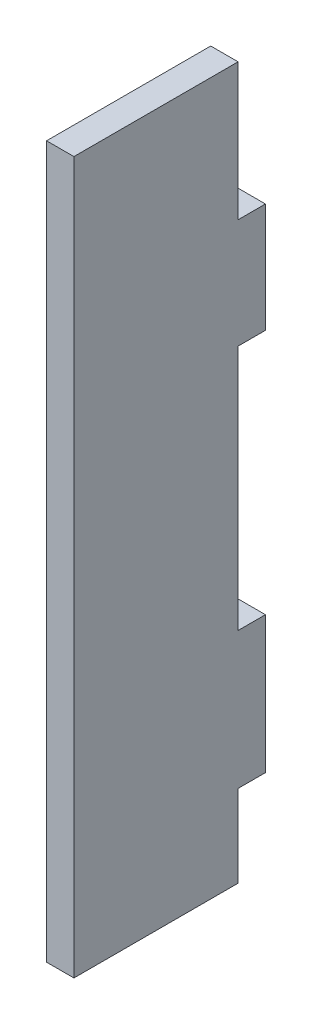
ISO-10303-21;
HEADER;
FILE_DESCRIPTION(('STEP AP214'),'2;1');
FILE_NAME('part.step','',(''),(''),'','','');
FILE_SCHEMA(('AUTOMOTIVE_DESIGN { 1 0 10303 214 1 1 1 1 }'));
ENDSEC;
DATA;
#1=APPLICATION_CONTEXT('core data for automotive mechanical design processes');
#2=APPLICATION_PROTOCOL_DEFINITION('international standard','automotive_design',2000,#1);
#3=PRODUCT_CONTEXT('',#1,'mechanical');
#4=PRODUCT('Part','Part','',(#3));
#5=PRODUCT_RELATED_PRODUCT_CATEGORY('part','',(#4));
#6=PRODUCT_DEFINITION_FORMATION('','',#4);
#7=PRODUCT_DEFINITION_CONTEXT('part definition',#1,'design');
#8=PRODUCT_DEFINITION('design','',#6,#7);
#9=PRODUCT_DEFINITION_SHAPE('','',#8);
#10=(LENGTH_UNIT() NAMED_UNIT(*) SI_UNIT(.MILLI.,.METRE.));
#11=(NAMED_UNIT(*) PLANE_ANGLE_UNIT() SI_UNIT($,.RADIAN.));
#12=(NAMED_UNIT(*) SI_UNIT($,.STERADIAN.) SOLID_ANGLE_UNIT());
#13=UNCERTAINTY_MEASURE_WITH_UNIT(LENGTH_MEASURE(1.E-05),#10,'distance_accuracy_value','');
#14=(GEOMETRIC_REPRESENTATION_CONTEXT(3) GLOBAL_UNCERTAINTY_ASSIGNED_CONTEXT((#13)) GLOBAL_UNIT_ASSIGNED_CONTEXT((#10,
#11,#12)) REPRESENTATION_CONTEXT('',''));
#15=CARTESIAN_POINT('',(0.,0.,0.));
#16=DIRECTION('',(0.,0.,1.));
#17=DIRECTION('',(1.,0.,0.));
#18=AXIS2_PLACEMENT_3D('',#15,#16,#17);
#19=CARTESIAN_POINT('',(0.,0.,5.));
#20=DIRECTION('',(0.,0.,1.));
#21=DIRECTION('',(1.,0.,0.));
#22=AXIS2_PLACEMENT_3D('',#19,#20,#21);
#23=PLANE('',#22);
#24=DIRECTION('',(1.,0.,0.));
#25=VECTOR('',#24,1.);
#26=CARTESIAN_POINT('',(-25.3835898575689,-44.1369228204701,5.));
#27=LINE('',#26,#25);
#28=CARTESIAN_POINT('',(-25.3835898575689,-44.1369228204701,5.));
#29=VERTEX_POINT('',#28);
#30=CARTESIAN_POINT('',(-20.3835898575689,-44.1369228204701,5.));
#31=VERTEX_POINT('',#30);
#32=EDGE_CURVE('E50',#29,#31,#27,.T.);
#33=ORIENTED_EDGE('',*,*,#32,.T.);
#34=DIRECTION('',(0.,1.,0.));
#35=VECTOR('',#34,1.);
#36=CARTESIAN_POINT('',(-20.3835898575689,70.8630771795299,5.));
#37=LINE('',#36,#35);
#38=CARTESIAN_POINT('',(-20.3835898575689,-59.1369228204701,5.));
#39=VERTEX_POINT('',#38);
#40=EDGE_CURVE('E142',#39,#31,#37,.T.);
#41=ORIENTED_EDGE('',*,*,#40,.F.);
#42=DIRECTION('',(1.,0.,0.));
#43=VECTOR('',#42,1.);
#44=CARTESIAN_POINT('',(-25.3835898575689,-59.1369228204701,5.));
#45=LINE('',#44,#43);
#46=CARTESIAN_POINT('',(-25.3835898575689,-59.1369228204701,5.));
#47=VERTEX_POINT('',#46);
#48=EDGE_CURVE('E158',#47,#39,#45,.T.);
#49=ORIENTED_EDGE('',*,*,#48,.F.);
#50=DIRECTION('',(0.,-1.,0.));
#51=VECTOR('',#50,1.);
#52=CARTESIAN_POINT('',(-25.3835898575689,70.8630771795299,5.));
#53=LINE('',#52,#51);
#54=EDGE_CURVE('E135',#29,#47,#53,.T.);
#55=ORIENTED_EDGE('',*,*,#54,.F.);
#56=EDGE_LOOP('',(#33,#41,#49,#55));
#57=FACE_BOUND('',#56,.T.);
#58=ADVANCED_FACE('F35',(#57),#23,.F.);
#59=DIRECTION('',(-1.,0.,0.));
#60=VECTOR('',#59,1.);
#61=CARTESIAN_POINT('',(-20.3835898575689,-19.1369228204701,5.));
#62=LINE('',#61,#60);
#63=CARTESIAN_POINT('',(-20.3835898575689,-19.1369228204701,5.));
#64=VERTEX_POINT('',#63);
#65=CARTESIAN_POINT('',(-25.3835898575689,-19.1369228204701,5.));
#66=VERTEX_POINT('',#65);
#67=EDGE_CURVE('E143',#64,#66,#62,.T.);
#68=ORIENTED_EDGE('',*,*,#67,.T.);
#69=CARTESIAN_POINT('',(-25.3835898575689,25.8630771795299,5.));
#70=VERTEX_POINT('',#69);
#71=EDGE_CURVE('E166',#70,#66,#53,.T.);
#72=ORIENTED_EDGE('',*,*,#71,.F.);
#73=DIRECTION('',(1.,0.,0.));
#74=VECTOR('',#73,1.);
#75=CARTESIAN_POINT('',(-25.3835898575689,25.8630771795299,5.));
#76=LINE('',#75,#74);
#77=CARTESIAN_POINT('',(-20.3835898575689,25.8630771795299,5.));
#78=VERTEX_POINT('',#77);
#79=EDGE_CURVE('E219',#70,#78,#76,.T.);
#80=ORIENTED_EDGE('',*,*,#79,.T.);
#81=EDGE_CURVE('E152',#64,#78,#37,.T.);
#82=ORIENTED_EDGE('',*,*,#81,.F.);
#83=EDGE_LOOP('',(#68,#72,#80,#82));
#84=FACE_BOUND('',#83,.T.);
#85=ADVANCED_FACE('F197',(#84),#23,.F.);
#86=CARTESIAN_POINT('',(-20.3835898575689,45.8630771795299,5.));
#87=DIRECTION('',(0.,-1.,0.));
#88=DIRECTION('',(0.,0.,-1.));
#89=AXIS2_PLACEMENT_3D('',#86,#87,#88);
#90=PLANE('',#89);
#91=DIRECTION('',(-1.,0.,0.));
#92=VECTOR('',#91,1.);
#93=CARTESIAN_POINT('',(-20.3835898575689,45.8630771795299,0.));
#94=LINE('',#93,#92);
#95=CARTESIAN_POINT('',(-20.3835898575689,45.8630771795299,0.));
#96=VERTEX_POINT('',#95);
#97=CARTESIAN_POINT('',(-25.3835898575689,45.8630771795299,0.));
#98=VERTEX_POINT('',#97);
#99=EDGE_CURVE('E209',#96,#98,#94,.T.);
#100=ORIENTED_EDGE('',*,*,#99,.T.);
#101=DIRECTION('',(0.,0.,-1.));
#102=VECTOR('',#101,1.);
#103=CARTESIAN_POINT('',(-25.3835898575689,45.8630771795299,5.));
#104=LINE('',#103,#102);
#105=CARTESIAN_POINT('',(-25.3835898575689,45.8630771795299,5.));
#106=VERTEX_POINT('',#105);
#107=EDGE_CURVE('E11',#106,#98,#104,.T.);
#108=ORIENTED_EDGE('',*,*,#107,.F.);
#109=DIRECTION('',(-1.,0.,0.));
#110=VECTOR('',#109,1.);
#111=CARTESIAN_POINT('',(-20.3835898575689,45.8630771795299,5.));
#112=LINE('',#111,#110);
#113=CARTESIAN_POINT('',(-20.3835898575689,45.8630771795299,5.));
#114=VERTEX_POINT('',#113);
#115=EDGE_CURVE('E217',#114,#106,#112,.T.);
#116=ORIENTED_EDGE('',*,*,#115,.F.);
#117=DIRECTION('',(0.,0.,-1.));
#118=VECTOR('',#117,1.);
#119=CARTESIAN_POINT('',(-20.3835898575689,45.8630771795299,5.));
#120=LINE('',#119,#118);
#121=EDGE_CURVE('E59',#114,#96,#120,.T.);
#122=ORIENTED_EDGE('',*,*,#121,.T.);
#123=EDGE_LOOP('',(#100,#108,#116,#122));
#124=FACE_BOUND('',#123,.T.);
#125=ADVANCED_FACE('F37',(#124),#90,.F.);
#126=CARTESIAN_POINT('',(-25.3835898575689,45.8630771795299,5.));
#127=DIRECTION('',(1.,0.,0.));
#128=DIRECTION('',(0.,1.,0.));
#129=AXIS2_PLACEMENT_3D('',#126,#127,#128);
#130=PLANE('',#129);
#131=DIRECTION('',(0.,-1.,0.));
#132=VECTOR('',#131,1.);
#133=CARTESIAN_POINT('',(-25.3835898575689,45.8630771795299,0.));
#134=LINE('',#133,#132);
#135=CARTESIAN_POINT('',(-25.3835898575689,25.8630771795299,0.));
#136=VERTEX_POINT('',#135);
#137=EDGE_CURVE('E211',#98,#136,#134,.T.);
#138=ORIENTED_EDGE('',*,*,#137,.T.);
#139=DIRECTION('',(0.,0.,-1.));
#140=VECTOR('',#139,1.);
#141=CARTESIAN_POINT('',(-25.3835898575689,25.8630771795299,5.));
#142=LINE('',#141,#140);
#143=EDGE_CURVE('E43',#70,#136,#142,.T.);
#144=ORIENTED_EDGE('',*,*,#143,.F.);
#145=ORIENTED_EDGE('',*,*,#71,.T.);
#146=DIRECTION('',(0.,0.,-1.));
#147=VECTOR('',#146,1.);
#148=CARTESIAN_POINT('',(-25.3835898575689,-19.1369228204701,5.));
#149=LINE('',#148,#147);
#150=CARTESIAN_POINT('',(-25.3835898575689,-19.1369228204701,0.));
#151=VERTEX_POINT('',#150);
#152=EDGE_CURVE('E180',#66,#151,#149,.T.);
#153=ORIENTED_EDGE('',*,*,#152,.T.);
#154=DIRECTION('',(0.,-1.,0.));
#155=VECTOR('',#154,1.);
#156=CARTESIAN_POINT('',(-25.3835898575689,-19.1369228204701,0.));
#157=LINE('',#156,#155);
#158=CARTESIAN_POINT('',(-25.3835898575689,-44.1369228204701,0.));
#159=VERTEX_POINT('',#158);
#160=EDGE_CURVE('E144',#151,#159,#157,.T.);
#161=ORIENTED_EDGE('',*,*,#160,.T.);
#162=DIRECTION('',(0.,0.,-1.));
#163=VECTOR('',#162,1.);
#164=CARTESIAN_POINT('',(-25.3835898575689,-44.1369228204701,5.));
#165=LINE('',#164,#163);
#166=EDGE_CURVE('E183',#29,#159,#165,.T.);
#167=ORIENTED_EDGE('',*,*,#166,.F.);
#168=ORIENTED_EDGE('',*,*,#54,.T.);
#169=DIRECTION('',(0.,0.,-1.));
#170=VECTOR('',#169,1.);
#171=CARTESIAN_POINT('',(-25.3835898575689,-59.1369228204701,35.));
#172=LINE('',#171,#170);
#173=CARTESIAN_POINT('',(-25.3835898575689,-59.1369228204701,35.));
#174=VERTEX_POINT('',#173);
#175=EDGE_CURVE('E207',#174,#47,#172,.T.);
#176=ORIENTED_EDGE('',*,*,#175,.F.);
#177=DIRECTION('',(0.,-1.,0.));
#178=VECTOR('',#177,1.);
#179=CARTESIAN_POINT('',(-25.3835898575689,70.8630771795299,35.));
#180=LINE('',#179,#178);
#181=CARTESIAN_POINT('',(-25.3835898575689,70.8630771795299,35.));
#182=VERTEX_POINT('',#181);
#183=EDGE_CURVE('E155',#182,#174,#180,.T.);
#184=ORIENTED_EDGE('',*,*,#183,.F.);
#185=DIRECTION('',(0.,0.,-1.));
#186=VECTOR('',#185,1.);
#187=CARTESIAN_POINT('',(-25.3835898575689,70.8630771795299,35.));
#188=LINE('',#187,#186);
#189=CARTESIAN_POINT('',(-25.3835898575689,70.8630771795299,5.));
#190=VERTEX_POINT('',#189);
#191=EDGE_CURVE('E171',#182,#190,#188,.T.);
#192=ORIENTED_EDGE('',*,*,#191,.T.);
#193=EDGE_CURVE('E162',#190,#106,#53,.T.);
#194=ORIENTED_EDGE('',*,*,#193,.T.);
#195=ORIENTED_EDGE('',*,*,#107,.T.);
#196=EDGE_LOOP('',(#138,#144,#145,#153,#161,#167,#168,#176,#184,#192,#194,#195));
#197=FACE_BOUND('',#196,.T.);
#198=ADVANCED_FACE('F201',(#197),#130,.F.);
#199=CARTESIAN_POINT('',(-25.3835898575689,25.8630771795299,5.));
#200=DIRECTION('',(0.,1.,0.));
#201=DIRECTION('',(-1.,0.,0.));
#202=AXIS2_PLACEMENT_3D('',#199,#200,#201);
#203=PLANE('',#202);
#204=DIRECTION('',(1.,0.,0.));
#205=VECTOR('',#204,1.);
#206=CARTESIAN_POINT('',(-25.3835898575689,25.8630771795299,0.));
#207=LINE('',#206,#205);
#208=CARTESIAN_POINT('',(-20.3835898575689,25.8630771795299,0.));
#209=VERTEX_POINT('',#208);
#210=EDGE_CURVE('E222',#136,#209,#207,.T.);
#211=ORIENTED_EDGE('',*,*,#210,.T.);
#212=DIRECTION('',(0.,0.,-1.));
#213=VECTOR('',#212,1.);
#214=CARTESIAN_POINT('',(-20.3835898575689,25.8630771795299,5.));
#215=LINE('',#214,#213);
#216=EDGE_CURVE('E226',#78,#209,#215,.T.);
#217=ORIENTED_EDGE('',*,*,#216,.F.);
#218=ORIENTED_EDGE('',*,*,#79,.F.);
#219=ORIENTED_EDGE('',*,*,#143,.T.);
#220=EDGE_LOOP('',(#211,#217,#218,#219));
#221=FACE_BOUND('',#220,.T.);
#222=ADVANCED_FACE('F229',(#221),#203,.F.);
#223=CARTESIAN_POINT('',(-20.3835898575689,25.8630771795299,5.));
#224=DIRECTION('',(-1.,0.,0.));
#225=DIRECTION('',(0.,-1.,0.));
#226=AXIS2_PLACEMENT_3D('',#223,#224,#225);
#227=PLANE('',#226);
#228=DIRECTION('',(0.,1.,0.));
#229=VECTOR('',#228,1.);
#230=CARTESIAN_POINT('',(-20.3835898575689,25.8630771795299,0.));
#231=LINE('',#230,#229);
#232=EDGE_CURVE('E78',#209,#96,#231,.T.);
#233=ORIENTED_EDGE('',*,*,#232,.T.);
#234=ORIENTED_EDGE('',*,*,#121,.F.);
#235=CARTESIAN_POINT('',(-20.3835898575689,70.8630771795299,5.));
#236=VERTEX_POINT('',#235);
#237=EDGE_CURVE('E154',#114,#236,#37,.T.);
#238=ORIENTED_EDGE('',*,*,#237,.T.);
#239=DIRECTION('',(0.,0.,-1.));
#240=VECTOR('',#239,1.);
#241=CARTESIAN_POINT('',(-20.3835898575689,70.8630771795299,35.));
#242=LINE('',#241,#240);
#243=CARTESIAN_POINT('',(-20.3835898575689,70.8630771795299,35.));
#244=VERTEX_POINT('',#243);
#245=EDGE_CURVE('E213',#244,#236,#242,.T.);
#246=ORIENTED_EDGE('',*,*,#245,.F.);
#247=DIRECTION('',(0.,1.,0.));
#248=VECTOR('',#247,1.);
#249=CARTESIAN_POINT('',(-20.3835898575689,70.8630771795299,35.));
#250=LINE('',#249,#248);
#251=CARTESIAN_POINT('',(-20.3835898575689,-59.1369228204701,35.));
#252=VERTEX_POINT('',#251);
#253=EDGE_CURVE('E172',#252,#244,#250,.T.);
#254=ORIENTED_EDGE('',*,*,#253,.F.);
#255=DIRECTION('',(0.,0.,-1.));
#256=VECTOR('',#255,1.);
#257=CARTESIAN_POINT('',(-20.3835898575689,-59.1369228204701,35.));
#258=LINE('',#257,#256);
#259=EDGE_CURVE('E150',#252,#39,#258,.T.);
#260=ORIENTED_EDGE('',*,*,#259,.T.);
#261=ORIENTED_EDGE('',*,*,#40,.T.);
#262=DIRECTION('',(0.,0.,-1.));
#263=VECTOR('',#262,1.);
#264=CARTESIAN_POINT('',(-20.3835898575689,-44.1369228204701,5.));
#265=LINE('',#264,#263);
#266=CARTESIAN_POINT('',(-20.3835898575689,-44.1369228204701,0.));
#267=VERTEX_POINT('',#266);
#268=EDGE_CURVE('E130',#31,#267,#265,.T.);
#269=ORIENTED_EDGE('',*,*,#268,.T.);
#270=DIRECTION('',(0.,1.,0.));
#271=VECTOR('',#270,1.);
#272=CARTESIAN_POINT('',(-20.3835898575689,-44.1369228204701,0.));
#273=LINE('',#272,#271);
#274=CARTESIAN_POINT('',(-20.3835898575689,-19.1369228204701,0.));
#275=VERTEX_POINT('',#274);
#276=EDGE_CURVE('E188',#267,#275,#273,.T.);
#277=ORIENTED_EDGE('',*,*,#276,.T.);
#278=DIRECTION('',(0.,0.,-1.));
#279=VECTOR('',#278,1.);
#280=CARTESIAN_POINT('',(-20.3835898575689,-19.1369228204701,5.));
#281=LINE('',#280,#279);
#282=EDGE_CURVE('E136',#64,#275,#281,.T.);
#283=ORIENTED_EDGE('',*,*,#282,.F.);
#284=ORIENTED_EDGE('',*,*,#81,.T.);
#285=ORIENTED_EDGE('',*,*,#216,.T.);
#286=EDGE_LOOP('',(#233,#234,#238,#246,#254,#260,#261,#269,#277,#283,#284,#285));
#287=FACE_BOUND('',#286,.T.);
#288=ADVANCED_FACE('F147',(#287),#227,.F.);
#289=CARTESIAN_POINT('',(0.,0.,0.));
#290=DIRECTION('',(0.,0.,1.));
#291=DIRECTION('',(1.,0.,0.));
#292=AXIS2_PLACEMENT_3D('',#289,#290,#291);
#293=PLANE('',#292);
#294=ORIENTED_EDGE('',*,*,#99,.F.);
#295=ORIENTED_EDGE('',*,*,#232,.F.);
#296=ORIENTED_EDGE('',*,*,#210,.F.);
#297=ORIENTED_EDGE('',*,*,#137,.F.);
#298=EDGE_LOOP('',(#294,#295,#296,#297));
#299=FACE_BOUND('',#298,.T.);
#300=ADVANCED_FACE('F233',(#299),#293,.F.);
#301=ORIENTED_EDGE('',*,*,#237,.F.);
#302=ORIENTED_EDGE('',*,*,#115,.T.);
#303=ORIENTED_EDGE('',*,*,#193,.F.);
#304=DIRECTION('',(-1.,0.,0.));
#305=VECTOR('',#304,1.);
#306=CARTESIAN_POINT('',(-25.3835898575689,70.8630771795299,5.));
#307=LINE('',#306,#305);
#308=EDGE_CURVE('E151',#236,#190,#307,.T.);
#309=ORIENTED_EDGE('',*,*,#308,.F.);
#310=EDGE_LOOP('',(#301,#302,#303,#309));
#311=FACE_BOUND('',#310,.T.);
#312=ADVANCED_FACE('F237',(#311),#23,.F.);
#313=CARTESIAN_POINT('',(-25.3835898575689,-59.1369228204701,35.));
#314=DIRECTION('',(0.,1.,0.));
#315=DIRECTION('',(0.,0.,1.));
#316=AXIS2_PLACEMENT_3D('',#313,#314,#315);
#317=PLANE('',#316);
#318=ORIENTED_EDGE('',*,*,#48,.T.);
#319=ORIENTED_EDGE('',*,*,#259,.F.);
#320=DIRECTION('',(1.,0.,0.));
#321=VECTOR('',#320,1.);
#322=CARTESIAN_POINT('',(-25.3835898575689,-59.1369228204701,35.));
#323=LINE('',#322,#321);
#324=EDGE_CURVE('E174',#174,#252,#323,.T.);
#325=ORIENTED_EDGE('',*,*,#324,.F.);
#326=ORIENTED_EDGE('',*,*,#175,.T.);
#327=EDGE_LOOP('',(#318,#319,#325,#326));
#328=FACE_BOUND('',#327,.T.);
#329=ADVANCED_FACE('F208',(#328),#317,.F.);
#330=CARTESIAN_POINT('',(-25.3835898575689,70.8630771795299,35.));
#331=DIRECTION('',(0.,-1.,0.));
#332=DIRECTION('',(0.,0.,-1.));
#333=AXIS2_PLACEMENT_3D('',#330,#331,#332);
#334=PLANE('',#333);
#335=ORIENTED_EDGE('',*,*,#308,.T.);
#336=ORIENTED_EDGE('',*,*,#191,.F.);
#337=DIRECTION('',(-1.,0.,0.));
#338=VECTOR('',#337,1.);
#339=CARTESIAN_POINT('',(-25.3835898575689,70.8630771795299,35.));
#340=LINE('',#339,#338);
#341=EDGE_CURVE('E169',#244,#182,#340,.T.);
#342=ORIENTED_EDGE('',*,*,#341,.F.);
#343=ORIENTED_EDGE('',*,*,#245,.T.);
#344=EDGE_LOOP('',(#335,#336,#342,#343));
#345=FACE_BOUND('',#344,.T.);
#346=ADVANCED_FACE('F241',(#345),#334,.F.);
#347=CARTESIAN_POINT('',(0.,0.,35.));
#348=DIRECTION('',(0.,0.,1.));
#349=DIRECTION('',(1.,0.,0.));
#350=AXIS2_PLACEMENT_3D('',#347,#348,#349);
#351=PLANE('',#350);
#352=ORIENTED_EDGE('',*,*,#183,.T.);
#353=ORIENTED_EDGE('',*,*,#324,.T.);
#354=ORIENTED_EDGE('',*,*,#253,.T.);
#355=ORIENTED_EDGE('',*,*,#341,.T.);
#356=EDGE_LOOP('',(#352,#353,#354,#355));
#357=FACE_BOUND('',#356,.T.);
#358=ADVANCED_FACE('F245',(#357),#351,.T.);
#359=CARTESIAN_POINT('',(-25.3835898575689,-44.1369228204701,5.));
#360=DIRECTION('',(0.,1.,0.));
#361=DIRECTION('',(0.,0.,1.));
#362=AXIS2_PLACEMENT_3D('',#359,#360,#361);
#363=PLANE('',#362);
#364=DIRECTION('',(1.,0.,0.));
#365=VECTOR('',#364,1.);
#366=CARTESIAN_POINT('',(-25.3835898575689,-44.1369228204701,0.));
#367=LINE('',#366,#365);
#368=EDGE_CURVE('E133',#159,#267,#367,.T.);
#369=ORIENTED_EDGE('',*,*,#368,.T.);
#370=ORIENTED_EDGE('',*,*,#268,.F.);
#371=ORIENTED_EDGE('',*,*,#32,.F.);
#372=ORIENTED_EDGE('',*,*,#166,.T.);
#373=EDGE_LOOP('',(#369,#370,#371,#372));
#374=FACE_BOUND('',#373,.T.);
#375=ADVANCED_FACE('F131',(#374),#363,.F.);
#376=CARTESIAN_POINT('',(-20.3835898575689,-19.1369228204701,5.));
#377=DIRECTION('',(0.,-1.,0.));
#378=DIRECTION('',(0.,0.,-1.));
#379=AXIS2_PLACEMENT_3D('',#376,#377,#378);
#380=PLANE('',#379);
#381=DIRECTION('',(-1.,0.,0.));
#382=VECTOR('',#381,1.);
#383=CARTESIAN_POINT('',(-20.3835898575689,-19.1369228204701,0.));
#384=LINE('',#383,#382);
#385=EDGE_CURVE('E186',#275,#151,#384,.T.);
#386=ORIENTED_EDGE('',*,*,#385,.T.);
#387=ORIENTED_EDGE('',*,*,#152,.F.);
#388=ORIENTED_EDGE('',*,*,#67,.F.);
#389=ORIENTED_EDGE('',*,*,#282,.T.);
#390=EDGE_LOOP('',(#386,#387,#388,#389));
#391=FACE_BOUND('',#390,.T.);
#392=ADVANCED_FACE('F252',(#391),#380,.F.);
#393=CARTESIAN_POINT('',(0.,0.,0.));
#394=DIRECTION('',(0.,0.,1.));
#395=DIRECTION('',(1.,0.,0.));
#396=AXIS2_PLACEMENT_3D('',#393,#394,#395);
#397=PLANE('',#396);
#398=ORIENTED_EDGE('',*,*,#368,.F.);
#399=ORIENTED_EDGE('',*,*,#160,.F.);
#400=ORIENTED_EDGE('',*,*,#385,.F.);
#401=ORIENTED_EDGE('',*,*,#276,.F.);
#402=EDGE_LOOP('',(#398,#399,#400,#401));
#403=FACE_BOUND('',#402,.T.);
#404=ADVANCED_FACE('F312',(#403),#397,.F.);
#405=CLOSED_SHELL('',(#58,#85,#125,#198,#222,#288,#300,#312,#329,#346,#358,#375,#392,#404));
#406=MANIFOLD_SOLID_BREP('B2',#405);
#407=ADVANCED_BREP_SHAPE_REPRESENTATION('',(#18,#406),#14);
#408=SHAPE_DEFINITION_REPRESENTATION(#9,#407);
ENDSEC;
END-ISO-10303-21;
